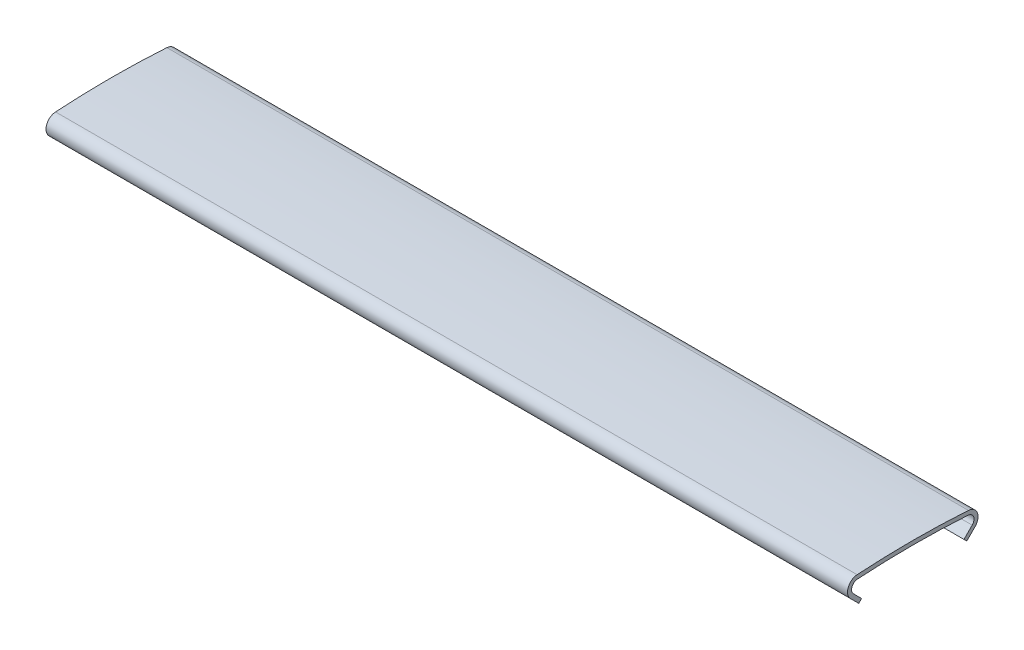
ISO-10303-21;
HEADER;
FILE_DESCRIPTION(('STEP AP214'),'2;1');
FILE_NAME('part.step','',(''),(''),'','','');
FILE_SCHEMA(('AUTOMOTIVE_DESIGN { 1 0 10303 214 1 1 1 1 }'));
ENDSEC;
DATA;
#1=APPLICATION_CONTEXT('core data for automotive mechanical design processes');
#2=APPLICATION_PROTOCOL_DEFINITION('international standard','automotive_design',2000,#1);
#3=PRODUCT_CONTEXT('',#1,'mechanical');
#4=PRODUCT('Part','Part','',(#3));
#5=PRODUCT_RELATED_PRODUCT_CATEGORY('part','',(#4));
#6=PRODUCT_DEFINITION_FORMATION('','',#4);
#7=PRODUCT_DEFINITION_CONTEXT('part definition',#1,'design');
#8=PRODUCT_DEFINITION('design','',#6,#7);
#9=PRODUCT_DEFINITION_SHAPE('','',#8);
#10=(LENGTH_UNIT() NAMED_UNIT(*) SI_UNIT(.MILLI.,.METRE.));
#11=(NAMED_UNIT(*) PLANE_ANGLE_UNIT() SI_UNIT($,.RADIAN.));
#12=(NAMED_UNIT(*) SI_UNIT($,.STERADIAN.) SOLID_ANGLE_UNIT());
#13=UNCERTAINTY_MEASURE_WITH_UNIT(LENGTH_MEASURE(1.E-05),#10,'distance_accuracy_value','');
#14=(GEOMETRIC_REPRESENTATION_CONTEXT(3) GLOBAL_UNCERTAINTY_ASSIGNED_CONTEXT((#13)) GLOBAL_UNIT_ASSIGNED_CONTEXT((#10,
#11,#12)) REPRESENTATION_CONTEXT('',''));
#15=CARTESIAN_POINT('',(0.,0.,0.));
#16=DIRECTION('',(0.,0.,1.));
#17=DIRECTION('',(1.,0.,0.));
#18=AXIS2_PLACEMENT_3D('',#15,#16,#17);
#19=CARTESIAN_POINT('',(43.,-1.29000028204481,5.90147308199342));
#20=DIRECTION('',(-1.,0.,0.));
#21=DIRECTION('',(0.,0.,1.));
#22=AXIS2_PLACEMENT_3D('',#19,#20,#21);
#23=CYLINDRICAL_SURFACE('',#22,0.668526918006594);
#24=CARTESIAN_POINT('',(-43.,-1.29000028204481,5.90147308199342));
#25=DIRECTION('',(-1.,0.,0.));
#26=DIRECTION('',(0.,0.,-1.));
#27=AXIS2_PLACEMENT_3D('',#24,#25,#26);
#28=CIRCLE('',#27,0.668526918006594);
#29=CARTESIAN_POINT('',(-43.,-1.76272019917301,6.37419299912162));
#30=VERTEX_POINT('',#29);
#31=CARTESIAN_POINT('',(-43.,-0.622879372182208,5.94480819158711));
#32=VERTEX_POINT('',#31);
#33=EDGE_CURVE('E154',#30,#32,#28,.T.);
#34=ORIENTED_EDGE('',*,*,#33,.T.);
#35=DIRECTION('',(-1.,0.,0.));
#36=VECTOR('',#35,1.);
#37=CARTESIAN_POINT('',(43.,-0.622879372182208,5.94480819158711));
#38=LINE('',#37,#36);
#39=CARTESIAN_POINT('',(43.,-0.622879372182208,5.94480819158711));
#40=VERTEX_POINT('',#39);
#41=EDGE_CURVE('E11',#40,#32,#38,.T.);
#42=ORIENTED_EDGE('',*,*,#41,.F.);
#43=CARTESIAN_POINT('',(43.,-1.29000028204481,5.90147308199342));
#44=DIRECTION('',(-1.,0.,0.));
#45=DIRECTION('',(0.,0.,-1.));
#46=AXIS2_PLACEMENT_3D('',#43,#44,#45);
#47=CIRCLE('',#46,0.668526918006594);
#48=CARTESIAN_POINT('',(43.,-1.76272019917301,6.37419299912162));
#49=VERTEX_POINT('',#48);
#50=EDGE_CURVE('E176',#49,#40,#47,.T.);
#51=ORIENTED_EDGE('',*,*,#50,.F.);
#52=DIRECTION('',(-1.,0.,0.));
#53=VECTOR('',#52,1.);
#54=CARTESIAN_POINT('',(43.,-1.76272019917301,6.37419299912162));
#55=LINE('',#54,#53);
#56=EDGE_CURVE('E150',#49,#30,#55,.T.);
#57=ORIENTED_EDGE('',*,*,#56,.T.);
#58=EDGE_LOOP('',(#34,#42,#51,#57));
#59=FACE_BOUND('',#58,.T.);
#60=ADVANCED_FACE('F34',(#59),#23,.F.);
#61=CARTESIAN_POINT('',(43.,-92.1400322515474,0.));
#62=DIRECTION('',(-1.,0.,0.));
#63=DIRECTION('',(0.,0.,1.));
#64=AXIS2_PLACEMENT_3D('',#61,#62,#63);
#65=CYLINDRICAL_SURFACE('',#64,91.7100322515474);
#66=CARTESIAN_POINT('',(-43.,-92.1400322515474,0.));
#67=DIRECTION('',(-1.,0.,0.));
#68=DIRECTION('',(0.,0.,-1.));
#69=AXIS2_PLACEMENT_3D('',#66,#67,#68);
#70=CIRCLE('',#69,91.7100322515474);
#71=CARTESIAN_POINT('',(-43.,-0.622879372182208,-5.9448081915871));
#72=VERTEX_POINT('',#71);
#73=EDGE_CURVE('E157',#32,#72,#70,.T.);
#74=ORIENTED_EDGE('',*,*,#73,.T.);
#75=DIRECTION('',(-1.,0.,0.));
#76=VECTOR('',#75,1.);
#77=CARTESIAN_POINT('',(43.,-0.622879372182208,-5.9448081915871));
#78=LINE('',#77,#76);
#79=CARTESIAN_POINT('',(43.,-0.622879372182208,-5.9448081915871));
#80=VERTEX_POINT('',#79);
#81=EDGE_CURVE('E42',#80,#72,#78,.T.);
#82=ORIENTED_EDGE('',*,*,#81,.F.);
#83=CARTESIAN_POINT('',(43.,-92.1400322515474,0.));
#84=DIRECTION('',(-1.,0.,0.));
#85=DIRECTION('',(0.,0.,-1.));
#86=AXIS2_PLACEMENT_3D('',#83,#84,#85);
#87=CIRCLE('',#86,91.7100322515474);
#88=EDGE_CURVE('E105',#40,#80,#87,.T.);
#89=ORIENTED_EDGE('',*,*,#88,.F.);
#90=ORIENTED_EDGE('',*,*,#41,.T.);
#91=EDGE_LOOP('',(#74,#82,#89,#90));
#92=FACE_BOUND('',#91,.T.);
#93=ADVANCED_FACE('F254',(#92),#65,.F.);
#94=CARTESIAN_POINT('',(43.,-1.29000028204481,-5.90147308199342));
#95=DIRECTION('',(-1.,0.,0.));
#96=DIRECTION('',(0.,0.,1.));
#97=AXIS2_PLACEMENT_3D('',#94,#95,#96);
#98=CYLINDRICAL_SURFACE('',#97,0.668526918006593);
#99=CARTESIAN_POINT('',(-43.,-1.29000028204481,-5.90147308199342));
#100=DIRECTION('',(-1.,0.,0.));
#101=DIRECTION('',(0.,0.,-1.));
#102=AXIS2_PLACEMENT_3D('',#99,#100,#101);
#103=CIRCLE('',#102,0.668526918006593);
#104=CARTESIAN_POINT('',(-43.,-1.76272019917301,-6.37419299912162));
#105=VERTEX_POINT('',#104);
#106=EDGE_CURVE('E159',#72,#105,#103,.T.);
#107=ORIENTED_EDGE('',*,*,#106,.T.);
#108=DIRECTION('',(-1.,0.,0.));
#109=VECTOR('',#108,1.);
#110=CARTESIAN_POINT('',(43.,-1.76272019917301,-6.37419299912162));
#111=LINE('',#110,#109);
#112=CARTESIAN_POINT('',(43.,-1.76272019917301,-6.37419299912162));
#113=VERTEX_POINT('',#112);
#114=EDGE_CURVE('E195',#113,#105,#111,.T.);
#115=ORIENTED_EDGE('',*,*,#114,.F.);
#116=CARTESIAN_POINT('',(43.,-1.29000028204481,-5.90147308199342));
#117=DIRECTION('',(-1.,0.,0.));
#118=DIRECTION('',(0.,0.,-1.));
#119=AXIS2_PLACEMENT_3D('',#116,#117,#118);
#120=CIRCLE('',#119,0.668526918006593);
#121=EDGE_CURVE('E203',#80,#113,#120,.T.);
#122=ORIENTED_EDGE('',*,*,#121,.F.);
#123=ORIENTED_EDGE('',*,*,#81,.T.);
#124=EDGE_LOOP('',(#107,#115,#122,#123));
#125=FACE_BOUND('',#124,.T.);
#126=ADVANCED_FACE('F201',(#125),#98,.F.);
#127=CARTESIAN_POINT('',(43.,-2.6474230348458,-5.48949016344883));
#128=DIRECTION('',(0.,-0.707106781186547,-0.707106781186548));
#129=DIRECTION('',(0.,0.707106781186548,-0.707106781186547));
#130=AXIS2_PLACEMENT_3D('',#127,#128,#129);
#131=PLANE('',#130);
#132=DIRECTION('',(0.,-0.707106781186548,0.707106781186547));
#133=VECTOR('',#132,1.);
#134=CARTESIAN_POINT('',(-43.,-2.6474230348458,-5.48949016344883));
#135=LINE('',#134,#133);
#136=CARTESIAN_POINT('',(-43.,-2.6474230348458,-5.48949016344883));
#137=VERTEX_POINT('',#136);
#138=EDGE_CURVE('E161',#105,#137,#135,.T.);
#139=ORIENTED_EDGE('',*,*,#138,.T.);
#140=DIRECTION('',(-1.,0.,0.));
#141=VECTOR('',#140,1.);
#142=CARTESIAN_POINT('',(43.,-2.6474230348458,-5.48949016344883));
#143=LINE('',#142,#141);
#144=CARTESIAN_POINT('',(43.,-2.6474230348458,-5.48949016344883));
#145=VERTEX_POINT('',#144);
#146=EDGE_CURVE('E192',#145,#137,#143,.T.);
#147=ORIENTED_EDGE('',*,*,#146,.F.);
#148=DIRECTION('',(0.,-0.707106781186548,0.707106781186547));
#149=VECTOR('',#148,1.);
#150=CARTESIAN_POINT('',(43.,-2.6474230348458,-5.48949016344883));
#151=LINE('',#150,#149);
#152=EDGE_CURVE('E221',#113,#145,#151,.T.);
#153=ORIENTED_EDGE('',*,*,#152,.F.);
#154=ORIENTED_EDGE('',*,*,#114,.T.);
#155=EDGE_LOOP('',(#139,#147,#153,#154));
#156=FACE_BOUND('',#155,.T.);
#157=ADVANCED_FACE('F212',(#156),#131,.F.);
#158=CARTESIAN_POINT('',(43.,-2.95147895075601,-5.79354607935904));
#159=DIRECTION('',(0.,0.707106781186548,-0.707106781186547));
#160=DIRECTION('',(0.,0.707106781186547,0.707106781186548));
#161=AXIS2_PLACEMENT_3D('',#158,#159,#160);
#162=PLANE('',#161);
#163=DIRECTION('',(0.,-0.707106781186547,-0.707106781186548));
#164=VECTOR('',#163,1.);
#165=CARTESIAN_POINT('',(-43.,-2.95147895075601,-5.79354607935904));
#166=LINE('',#165,#164);
#167=CARTESIAN_POINT('',(-43.,-2.95147895075601,-5.79354607935904));
#168=VERTEX_POINT('',#167);
#169=EDGE_CURVE('E163',#137,#168,#166,.T.);
#170=ORIENTED_EDGE('',*,*,#169,.T.);
#171=DIRECTION('',(-1.,0.,0.));
#172=VECTOR('',#171,1.);
#173=CARTESIAN_POINT('',(43.,-2.95147895075601,-5.79354607935904));
#174=LINE('',#173,#172);
#175=CARTESIAN_POINT('',(43.,-2.95147895075601,-5.79354607935904));
#176=VERTEX_POINT('',#175);
#177=EDGE_CURVE('E189',#176,#168,#174,.T.);
#178=ORIENTED_EDGE('',*,*,#177,.F.);
#179=DIRECTION('',(0.,-0.707106781186547,-0.707106781186548));
#180=VECTOR('',#179,1.);
#181=CARTESIAN_POINT('',(43.,-2.95147895075601,-5.79354607935904));
#182=LINE('',#181,#180);
#183=EDGE_CURVE('E218',#145,#176,#182,.T.);
#184=ORIENTED_EDGE('',*,*,#183,.F.);
#185=ORIENTED_EDGE('',*,*,#146,.T.);
#186=EDGE_LOOP('',(#170,#178,#184,#185));
#187=FACE_BOUND('',#186,.T.);
#188=ADVANCED_FACE('F216',(#187),#162,.F.);
#189=CARTESIAN_POINT('',(43.,-2.06677611508322,-6.67824891503183));
#190=DIRECTION('',(0.,0.707106781186548,0.707106781186547));
#191=DIRECTION('',(0.,-0.707106781186547,0.707106781186548));
#192=AXIS2_PLACEMENT_3D('',#189,#190,#191);
#193=PLANE('',#192);
#194=DIRECTION('',(0.,0.707106781186547,-0.707106781186548));
#195=VECTOR('',#194,1.);
#196=CARTESIAN_POINT('',(-43.,-2.06677611508322,-6.67824891503183));
#197=LINE('',#196,#195);
#198=CARTESIAN_POINT('',(-43.,-2.06677611508322,-6.67824891503183));
#199=VERTEX_POINT('',#198);
#200=EDGE_CURVE('E165',#168,#199,#197,.T.);
#201=ORIENTED_EDGE('',*,*,#200,.T.);
#202=DIRECTION('',(-1.,0.,0.));
#203=VECTOR('',#202,1.);
#204=CARTESIAN_POINT('',(43.,-2.06677611508322,-6.67824891503183));
#205=LINE('',#204,#203);
#206=CARTESIAN_POINT('',(43.,-2.06677611508322,-6.67824891503183));
#207=VERTEX_POINT('',#206);
#208=EDGE_CURVE('E186',#207,#199,#205,.T.);
#209=ORIENTED_EDGE('',*,*,#208,.F.);
#210=DIRECTION('',(0.,0.707106781186547,-0.707106781186548));
#211=VECTOR('',#210,1.);
#212=CARTESIAN_POINT('',(43.,-2.06677611508322,-6.67824891503183));
#213=LINE('',#212,#211);
#214=EDGE_CURVE('E220',#176,#207,#213,.T.);
#215=ORIENTED_EDGE('',*,*,#214,.F.);
#216=ORIENTED_EDGE('',*,*,#177,.T.);
#217=EDGE_LOOP('',(#201,#209,#215,#216));
#218=FACE_BOUND('',#217,.T.);
#219=ADVANCED_FACE('F267',(#218),#193,.F.);
#220=CARTESIAN_POINT('',(43.,-1.29000028204481,-5.90147308199342));
#221=DIRECTION('',(-1.,0.,0.));
#222=DIRECTION('',(0.,0.,1.));
#223=AXIS2_PLACEMENT_3D('',#220,#221,#222);
#224=CYLINDRICAL_SURFACE('',#223,1.09852691800658);
#225=CARTESIAN_POINT('',(-43.,-1.29000028204481,-5.90147308199342));
#226=DIRECTION('',(1.,0.,0.));
#227=DIRECTION('',(0.,0.,-1.));
#228=AXIS2_PLACEMENT_3D('',#225,#226,#227);
#229=CIRCLE('',#228,1.09852691800658);
#230=CARTESIAN_POINT('',(-43.,-0.193783723952711,-5.97268156006845));
#231=VERTEX_POINT('',#230);
#232=EDGE_CURVE('E167',#199,#231,#229,.T.);
#233=ORIENTED_EDGE('',*,*,#232,.T.);
#234=DIRECTION('',(-1.,0.,0.));
#235=VECTOR('',#234,1.);
#236=CARTESIAN_POINT('',(43.,-0.193783723952711,-5.97268156006845));
#237=LINE('',#236,#235);
#238=CARTESIAN_POINT('',(43.,-0.193783723952711,-5.97268156006845));
#239=VERTEX_POINT('',#238);
#240=EDGE_CURVE('E183',#239,#231,#237,.T.);
#241=ORIENTED_EDGE('',*,*,#240,.F.);
#242=CARTESIAN_POINT('',(43.,-1.29000028204481,-5.90147308199342));
#243=DIRECTION('',(1.,0.,0.));
#244=DIRECTION('',(0.,0.,-1.));
#245=AXIS2_PLACEMENT_3D('',#242,#243,#244);
#246=CIRCLE('',#245,1.09852691800658);
#247=EDGE_CURVE('E223',#207,#239,#246,.T.);
#248=ORIENTED_EDGE('',*,*,#247,.F.);
#249=ORIENTED_EDGE('',*,*,#208,.T.);
#250=EDGE_LOOP('',(#233,#241,#248,#249));
#251=FACE_BOUND('',#250,.T.);
#252=ADVANCED_FACE('F270',(#251),#224,.T.);
#253=CARTESIAN_POINT('',(43.,-92.1400322515474,0.));
#254=DIRECTION('',(-1.,0.,0.));
#255=DIRECTION('',(0.,0.,1.));
#256=AXIS2_PLACEMENT_3D('',#253,#254,#255);
#257=CYLINDRICAL_SURFACE('',#256,92.1400322515474);
#258=CARTESIAN_POINT('',(-43.,-92.1400322515474,0.));
#259=DIRECTION('',(1.,0.,0.));
#260=DIRECTION('',(0.,0.,-1.));
#261=AXIS2_PLACEMENT_3D('',#258,#259,#260);
#262=CIRCLE('',#261,92.1400322515474);
#263=CARTESIAN_POINT('',(-43.,-0.193783723952692,5.97268156006845));
#264=VERTEX_POINT('',#263);
#265=EDGE_CURVE('E169',#231,#264,#262,.T.);
#266=ORIENTED_EDGE('',*,*,#265,.T.);
#267=DIRECTION('',(-1.,0.,0.));
#268=VECTOR('',#267,1.);
#269=CARTESIAN_POINT('',(43.,-0.193783723952692,5.97268156006845));
#270=LINE('',#269,#268);
#271=CARTESIAN_POINT('',(43.,-0.193783723952692,5.97268156006845));
#272=VERTEX_POINT('',#271);
#273=EDGE_CURVE('E180',#272,#264,#270,.T.);
#274=ORIENTED_EDGE('',*,*,#273,.F.);
#275=CARTESIAN_POINT('',(43.,-92.1400322515474,0.));
#276=DIRECTION('',(1.,0.,0.));
#277=DIRECTION('',(0.,0.,-1.));
#278=AXIS2_PLACEMENT_3D('',#275,#276,#277);
#279=CIRCLE('',#278,92.1400322515474);
#280=EDGE_CURVE('E229',#239,#272,#279,.T.);
#281=ORIENTED_EDGE('',*,*,#280,.F.);
#282=ORIENTED_EDGE('',*,*,#240,.T.);
#283=EDGE_LOOP('',(#266,#274,#281,#282));
#284=FACE_BOUND('',#283,.T.);
#285=ADVANCED_FACE('F235',(#284),#257,.T.);
#286=CARTESIAN_POINT('',(43.,-1.29000028204481,5.90147308199342));
#287=DIRECTION('',(-1.,0.,0.));
#288=DIRECTION('',(0.,0.,1.));
#289=AXIS2_PLACEMENT_3D('',#286,#287,#288);
#290=CYLINDRICAL_SURFACE('',#289,1.09852691800658);
#291=CARTESIAN_POINT('',(-43.,-1.29000028204481,5.90147308199342));
#292=DIRECTION('',(1.,0.,0.));
#293=DIRECTION('',(0.,0.,-1.));
#294=AXIS2_PLACEMENT_3D('',#291,#292,#293);
#295=CIRCLE('',#294,1.09852691800658);
#296=CARTESIAN_POINT('',(-43.,-2.06677611508322,6.67824891503183));
#297=VERTEX_POINT('',#296);
#298=EDGE_CURVE('E171',#264,#297,#295,.T.);
#299=ORIENTED_EDGE('',*,*,#298,.T.);
#300=DIRECTION('',(-1.,0.,0.));
#301=VECTOR('',#300,1.);
#302=CARTESIAN_POINT('',(43.,-2.06677611508322,6.67824891503183));
#303=LINE('',#302,#301);
#304=CARTESIAN_POINT('',(43.,-2.06677611508322,6.67824891503183));
#305=VERTEX_POINT('',#304);
#306=EDGE_CURVE('E145',#305,#297,#303,.T.);
#307=ORIENTED_EDGE('',*,*,#306,.F.);
#308=CARTESIAN_POINT('',(43.,-1.29000028204481,5.90147308199342));
#309=DIRECTION('',(1.,0.,0.));
#310=DIRECTION('',(0.,0.,-1.));
#311=AXIS2_PLACEMENT_3D('',#308,#309,#310);
#312=CIRCLE('',#311,1.09852691800658);
#313=EDGE_CURVE('E136',#272,#305,#312,.T.);
#314=ORIENTED_EDGE('',*,*,#313,.F.);
#315=ORIENTED_EDGE('',*,*,#273,.T.);
#316=EDGE_LOOP('',(#299,#307,#314,#315));
#317=FACE_BOUND('',#316,.T.);
#318=ADVANCED_FACE('F239',(#317),#290,.T.);
#319=CARTESIAN_POINT('',(43.,-2.06677611508322,6.67824891503183));
#320=DIRECTION('',(0.,0.707106781186547,-0.707106781186548));
#321=DIRECTION('',(0.,0.707106781186548,0.707106781186547));
#322=AXIS2_PLACEMENT_3D('',#319,#320,#321);
#323=PLANE('',#322);
#324=DIRECTION('',(0.,-0.707106781186548,-0.707106781186547));
#325=VECTOR('',#324,1.);
#326=CARTESIAN_POINT('',(-43.,-2.06677611508322,6.67824891503183));
#327=LINE('',#326,#325);
#328=CARTESIAN_POINT('',(-43.,-2.95147895075601,5.79354607935904));
#329=VERTEX_POINT('',#328);
#330=EDGE_CURVE('E144',#297,#329,#327,.T.);
#331=ORIENTED_EDGE('',*,*,#330,.T.);
#332=DIRECTION('',(-1.,0.,0.));
#333=VECTOR('',#332,1.);
#334=CARTESIAN_POINT('',(43.,-2.95147895075601,5.79354607935904));
#335=LINE('',#334,#333);
#336=CARTESIAN_POINT('',(43.,-2.95147895075601,5.79354607935904));
#337=VERTEX_POINT('',#336);
#338=EDGE_CURVE('E141',#337,#329,#335,.T.);
#339=ORIENTED_EDGE('',*,*,#338,.F.);
#340=DIRECTION('',(0.,-0.707106781186548,-0.707106781186547));
#341=VECTOR('',#340,1.);
#342=CARTESIAN_POINT('',(43.,-2.06677611508322,6.67824891503183));
#343=LINE('',#342,#341);
#344=EDGE_CURVE('E130',#305,#337,#343,.T.);
#345=ORIENTED_EDGE('',*,*,#344,.F.);
#346=ORIENTED_EDGE('',*,*,#306,.T.);
#347=EDGE_LOOP('',(#331,#339,#345,#346));
#348=FACE_BOUND('',#347,.T.);
#349=ADVANCED_FACE('F142',(#348),#323,.F.);
#350=CARTESIAN_POINT('',(43.,-2.95147895075601,5.79354607935904));
#351=DIRECTION('',(0.,0.707106781186547,0.707106781186548));
#352=DIRECTION('',(0.,-0.707106781186548,0.707106781186547));
#353=AXIS2_PLACEMENT_3D('',#350,#351,#352);
#354=PLANE('',#353);
#355=DIRECTION('',(0.,0.707106781186548,-0.707106781186547));
#356=VECTOR('',#355,1.);
#357=CARTESIAN_POINT('',(-43.,-2.95147895075601,5.79354607935904));
#358=LINE('',#357,#356);
#359=CARTESIAN_POINT('',(-43.,-2.6474230348458,5.48949016344883));
#360=VERTEX_POINT('',#359);
#361=EDGE_CURVE('E91',#329,#360,#358,.T.);
#362=ORIENTED_EDGE('',*,*,#361,.T.);
#363=DIRECTION('',(-1.,0.,0.));
#364=VECTOR('',#363,1.);
#365=CARTESIAN_POINT('',(43.,-2.6474230348458,5.48949016344883));
#366=LINE('',#365,#364);
#367=CARTESIAN_POINT('',(43.,-2.6474230348458,5.48949016344883));
#368=VERTEX_POINT('',#367);
#369=EDGE_CURVE('E146',#368,#360,#366,.T.);
#370=ORIENTED_EDGE('',*,*,#369,.F.);
#371=DIRECTION('',(0.,0.707106781186548,-0.707106781186547));
#372=VECTOR('',#371,1.);
#373=CARTESIAN_POINT('',(43.,-2.95147895075601,5.79354607935904));
#374=LINE('',#373,#372);
#375=EDGE_CURVE('E134',#337,#368,#374,.T.);
#376=ORIENTED_EDGE('',*,*,#375,.F.);
#377=ORIENTED_EDGE('',*,*,#338,.T.);
#378=EDGE_LOOP('',(#362,#370,#376,#377));
#379=FACE_BOUND('',#378,.T.);
#380=ADVANCED_FACE('F148',(#379),#354,.F.);
#381=CARTESIAN_POINT('',(43.,-2.6474230348458,5.48949016344883));
#382=DIRECTION('',(0.,-0.707106781186547,0.707106781186548));
#383=DIRECTION('',(0.,-0.707106781186548,-0.707106781186547));
#384=AXIS2_PLACEMENT_3D('',#381,#382,#383);
#385=PLANE('',#384);
#386=DIRECTION('',(0.,0.707106781186548,0.707106781186547));
#387=VECTOR('',#386,1.);
#388=CARTESIAN_POINT('',(-43.,-2.6474230348458,5.48949016344883));
#389=LINE('',#388,#387);
#390=EDGE_CURVE('E97',#360,#30,#389,.T.);
#391=ORIENTED_EDGE('',*,*,#390,.T.);
#392=ORIENTED_EDGE('',*,*,#56,.F.);
#393=DIRECTION('',(0.,0.707106781186548,0.707106781186547));
#394=VECTOR('',#393,1.);
#395=CARTESIAN_POINT('',(43.,-2.6474230348458,5.48949016344883));
#396=LINE('',#395,#394);
#397=EDGE_CURVE('E50',#368,#49,#396,.T.);
#398=ORIENTED_EDGE('',*,*,#397,.F.);
#399=ORIENTED_EDGE('',*,*,#369,.T.);
#400=EDGE_LOOP('',(#391,#392,#398,#399));
#401=FACE_BOUND('',#400,.T.);
#402=ADVANCED_FACE('F243',(#401),#385,.F.);
#403=CARTESIAN_POINT('',(43.,-1.29000028204481,5.90147308199342));
#404=DIRECTION('',(1.,0.,0.));
#405=DIRECTION('',(0.,0.,-1.));
#406=AXIS2_PLACEMENT_3D('',#403,#404,#405);
#407=PLANE('',#406);
#408=ORIENTED_EDGE('',*,*,#50,.T.);
#409=ORIENTED_EDGE('',*,*,#88,.T.);
#410=ORIENTED_EDGE('',*,*,#121,.T.);
#411=ORIENTED_EDGE('',*,*,#152,.T.);
#412=ORIENTED_EDGE('',*,*,#183,.T.);
#413=ORIENTED_EDGE('',*,*,#214,.T.);
#414=ORIENTED_EDGE('',*,*,#247,.T.);
#415=ORIENTED_EDGE('',*,*,#280,.T.);
#416=ORIENTED_EDGE('',*,*,#313,.T.);
#417=ORIENTED_EDGE('',*,*,#344,.T.);
#418=ORIENTED_EDGE('',*,*,#375,.T.);
#419=ORIENTED_EDGE('',*,*,#397,.T.);
#420=EDGE_LOOP('',(#408,#409,#410,#411,#412,#413,#414,#415,#416,#417,#418,#419));
#421=FACE_BOUND('',#420,.T.);
#422=ADVANCED_FACE('F132',(#421),#407,.T.);
#423=CARTESIAN_POINT('',(-43.,-1.29000028204481,5.90147308199342));
#424=DIRECTION('',(1.,0.,0.));
#425=DIRECTION('',(0.,0.,-1.));
#426=AXIS2_PLACEMENT_3D('',#423,#424,#425);
#427=PLANE('',#426);
#428=ORIENTED_EDGE('',*,*,#33,.F.);
#429=ORIENTED_EDGE('',*,*,#390,.F.);
#430=ORIENTED_EDGE('',*,*,#361,.F.);
#431=ORIENTED_EDGE('',*,*,#330,.F.);
#432=ORIENTED_EDGE('',*,*,#298,.F.);
#433=ORIENTED_EDGE('',*,*,#265,.F.);
#434=ORIENTED_EDGE('',*,*,#232,.F.);
#435=ORIENTED_EDGE('',*,*,#200,.F.);
#436=ORIENTED_EDGE('',*,*,#169,.F.);
#437=ORIENTED_EDGE('',*,*,#138,.F.);
#438=ORIENTED_EDGE('',*,*,#106,.F.);
#439=ORIENTED_EDGE('',*,*,#73,.F.);
#440=EDGE_LOOP('',(#428,#429,#430,#431,#432,#433,#434,#435,#436,#437,#438,#439));
#441=FACE_BOUND('',#440,.T.);
#442=ADVANCED_FACE('F207',(#441),#427,.F.);
#443=CLOSED_SHELL('',(#60,#93,#126,#157,#188,#219,#252,#285,#318,#349,#380,#402,#422,#442));
#444=MANIFOLD_SOLID_BREP('B2',#443);
#445=ADVANCED_BREP_SHAPE_REPRESENTATION('',(#18,#444),#14);
#446=SHAPE_DEFINITION_REPRESENTATION(#9,#445);
ENDSEC;
END-ISO-10303-21;
